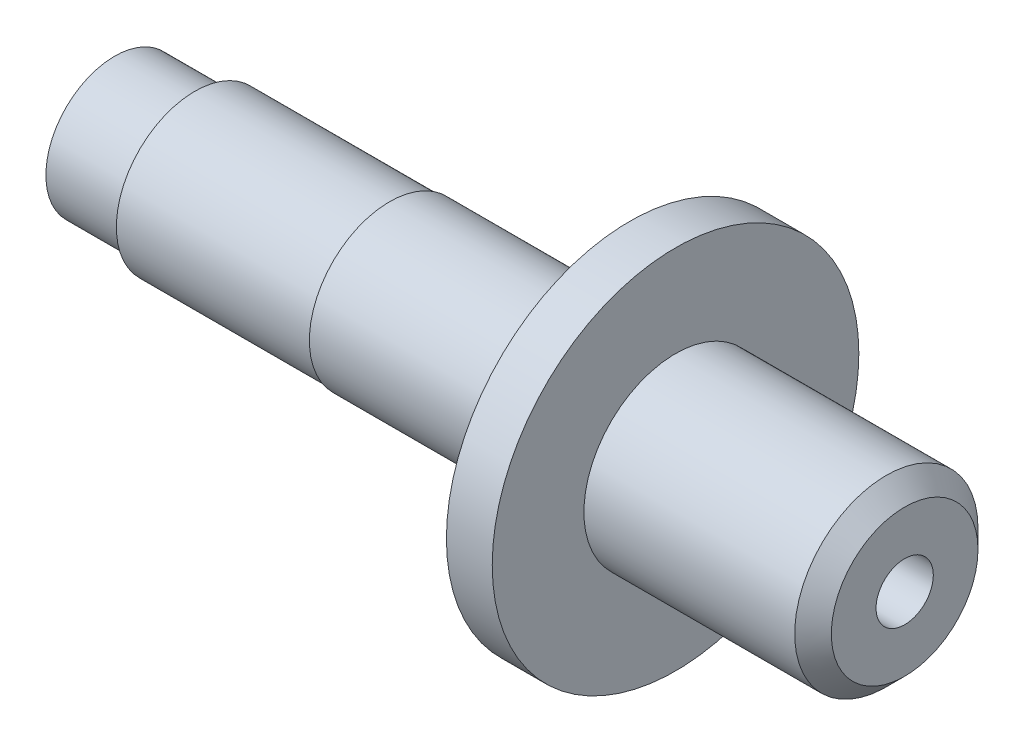
ISO-10303-21;
HEADER;
FILE_DESCRIPTION(('STEP AP214'),'2;1');
FILE_NAME('part.step','',(''),(''),'','','');
FILE_SCHEMA(('AUTOMOTIVE_DESIGN { 1 0 10303 214 1 1 1 1 }'));
ENDSEC;
DATA;
#1=APPLICATION_CONTEXT('core data for automotive mechanical design processes');
#2=APPLICATION_PROTOCOL_DEFINITION('international standard','automotive_design',2000,#1);
#3=PRODUCT_CONTEXT('',#1,'mechanical');
#4=PRODUCT('Part','Part','',(#3));
#5=PRODUCT_RELATED_PRODUCT_CATEGORY('part','',(#4));
#6=PRODUCT_DEFINITION_FORMATION('','',#4);
#7=PRODUCT_DEFINITION_CONTEXT('part definition',#1,'design');
#8=PRODUCT_DEFINITION('design','',#6,#7);
#9=PRODUCT_DEFINITION_SHAPE('','',#8);
#10=(LENGTH_UNIT() NAMED_UNIT(*) SI_UNIT(.MILLI.,.METRE.));
#11=(NAMED_UNIT(*) PLANE_ANGLE_UNIT() SI_UNIT($,.RADIAN.));
#12=(NAMED_UNIT(*) SI_UNIT($,.STERADIAN.) SOLID_ANGLE_UNIT());
#13=UNCERTAINTY_MEASURE_WITH_UNIT(LENGTH_MEASURE(1.E-05),#10,'distance_accuracy_value','');
#14=(GEOMETRIC_REPRESENTATION_CONTEXT(3) GLOBAL_UNCERTAINTY_ASSIGNED_CONTEXT((#13)) GLOBAL_UNIT_ASSIGNED_CONTEXT((#10,
#11,#12)) REPRESENTATION_CONTEXT('',''));
#15=CARTESIAN_POINT('',(0.,0.,0.));
#16=DIRECTION('',(0.,0.,1.));
#17=DIRECTION('',(1.,0.,0.));
#18=AXIS2_PLACEMENT_3D('',#15,#16,#17);
#19=CARTESIAN_POINT('',(109.474,12.7,0.));
#20=DIRECTION('',(1.,0.,0.));
#21=DIRECTION('',(0.,0.,-0.999999999999999));
#22=AXIS2_PLACEMENT_3D('',#19,#20,#21);
#23=PLANE('',#22);
#24=CARTESIAN_POINT('',(109.474,0.,0.));
#25=DIRECTION('',(1.,0.,0.));
#26=DIRECTION('',(0.,0.,-0.999999999999999));
#27=AXIS2_PLACEMENT_3D('',#24,#25,#26);
#28=CIRCLE('',#27,10.16);
#29=CARTESIAN_POINT('',(109.474,0.,-10.16));
#30=VERTEX_POINT('',#29);
#31=EDGE_CURVE('E36',#30,#30,#28,.T.);
#32=ORIENTED_EDGE('',*,*,#31,.T.);
#33=EDGE_LOOP('',(#32));
#34=FACE_BOUND('',#33,.T.);
#35=CARTESIAN_POINT('',(109.474,0.,0.));
#36=DIRECTION('',(1.,0.,0.));
#37=DIRECTION('',(0.,0.,-0.999999999999999));
#38=AXIS2_PLACEMENT_3D('',#35,#36,#37);
#39=CIRCLE('',#38,3.96875);
#40=CARTESIAN_POINT('',(109.474,0.,-3.96875));
#41=VERTEX_POINT('',#40);
#42=EDGE_CURVE('E88',#41,#41,#39,.T.);
#43=ORIENTED_EDGE('',*,*,#42,.F.);
#44=EDGE_LOOP('',(#43));
#45=FACE_BOUND('',#44,.T.);
#46=ADVANCED_FACE('F30',(#34,#45),#23,.T.);
#47=CARTESIAN_POINT('',(109.474,0.,0.));
#48=DIRECTION('',(1.,0.,0.));
#49=DIRECTION('',(0.,0.,-0.999999999999999));
#50=AXIS2_PLACEMENT_3D('',#47,#48,#49);
#51=CYLINDRICAL_SURFACE('',#50,12.7);
#52=CARTESIAN_POINT('',(106.934,0.,0.));
#53=DIRECTION('',(1.,0.,0.));
#54=DIRECTION('',(0.,0.,-0.999999999999999));
#55=AXIS2_PLACEMENT_3D('',#52,#53,#54);
#56=CIRCLE('',#55,12.7);
#57=CARTESIAN_POINT('',(106.934,0.,-12.7));
#58=VERTEX_POINT('',#57);
#59=EDGE_CURVE('E10',#58,#58,#56,.F.);
#60=ORIENTED_EDGE('',*,*,#59,.T.);
#61=EDGE_LOOP('',(#60));
#62=FACE_BOUND('',#61,.T.);
#63=CARTESIAN_POINT('',(77.724,0.,0.));
#64=DIRECTION('',(1.,0.,0.));
#65=DIRECTION('',(0.,0.,-0.999999999999999));
#66=AXIS2_PLACEMENT_3D('',#63,#64,#65);
#67=CIRCLE('',#66,12.7);
#68=CARTESIAN_POINT('',(77.724,0.,-12.7));
#69=VERTEX_POINT('',#68);
#70=EDGE_CURVE('E40',#69,#69,#67,.T.);
#71=ORIENTED_EDGE('',*,*,#70,.T.);
#72=EDGE_LOOP('',(#71));
#73=FACE_BOUND('',#72,.T.);
#74=ADVANCED_FACE('F95',(#62,#73),#51,.T.);
#75=CARTESIAN_POINT('',(77.724,25.3999999999999,0.));
#76=DIRECTION('',(1.,0.,0.));
#77=DIRECTION('',(0.,0.,-0.999999999999999));
#78=AXIS2_PLACEMENT_3D('',#75,#76,#77);
#79=PLANE('',#78);
#80=CARTESIAN_POINT('',(77.724,0.,0.));
#81=DIRECTION('',(1.,0.,0.));
#82=DIRECTION('',(0.,0.,-0.999999999999999));
#83=AXIS2_PLACEMENT_3D('',#80,#81,#82);
#84=CIRCLE('',#83,25.4);
#85=CARTESIAN_POINT('',(77.724,0.,-25.4));
#86=VERTEX_POINT('',#85);
#87=EDGE_CURVE('E44',#86,#86,#84,.T.);
#88=ORIENTED_EDGE('',*,*,#87,.T.);
#89=EDGE_LOOP('',(#88));
#90=FACE_BOUND('',#89,.T.);
#91=ORIENTED_EDGE('',*,*,#70,.F.);
#92=EDGE_LOOP('',(#91));
#93=FACE_BOUND('',#92,.T.);
#94=ADVANCED_FACE('F99',(#90,#93),#79,.T.);
#95=CARTESIAN_POINT('',(109.474,0.,0.));
#96=DIRECTION('',(1.,0.,0.));
#97=DIRECTION('',(0.,0.,-0.999999999999999));
#98=AXIS2_PLACEMENT_3D('',#95,#96,#97);
#99=CYLINDRICAL_SURFACE('',#98,25.4);
#100=CARTESIAN_POINT('',(71.374,0.,0.));
#101=DIRECTION('',(1.,0.,0.));
#102=DIRECTION('',(0.,0.,-0.999999999999999));
#103=AXIS2_PLACEMENT_3D('',#100,#101,#102);
#104=CIRCLE('',#103,25.4);
#105=CARTESIAN_POINT('',(71.374,0.,-25.4));
#106=VERTEX_POINT('',#105);
#107=EDGE_CURVE('E49',#106,#106,#104,.T.);
#108=ORIENTED_EDGE('',*,*,#107,.T.);
#109=EDGE_LOOP('',(#108));
#110=FACE_BOUND('',#109,.T.);
#111=ORIENTED_EDGE('',*,*,#87,.F.);
#112=EDGE_LOOP('',(#111));
#113=FACE_BOUND('',#112,.T.);
#114=ADVANCED_FACE('F103',(#110,#113),#99,.T.);
#115=CARTESIAN_POINT('',(71.374,17.78,0.));
#116=DIRECTION('',(-1.,0.,0.));
#117=DIRECTION('',(0.,0.,0.999999999999999));
#118=AXIS2_PLACEMENT_3D('',#115,#116,#117);
#119=PLANE('',#118);
#120=CARTESIAN_POINT('',(71.374,0.,0.));
#121=DIRECTION('',(1.,0.,0.));
#122=DIRECTION('',(0.,0.,-0.999999999999999));
#123=AXIS2_PLACEMENT_3D('',#120,#121,#122);
#124=CIRCLE('',#123,17.78);
#125=CARTESIAN_POINT('',(71.374,0.,-17.78));
#126=VERTEX_POINT('',#125);
#127=EDGE_CURVE('E52',#126,#126,#124,.T.);
#128=ORIENTED_EDGE('',*,*,#127,.T.);
#129=EDGE_LOOP('',(#128));
#130=FACE_BOUND('',#129,.T.);
#131=ORIENTED_EDGE('',*,*,#107,.F.);
#132=EDGE_LOOP('',(#131));
#133=FACE_BOUND('',#132,.T.);
#134=ADVANCED_FACE('F110',(#130,#133),#119,.T.);
#135=CARTESIAN_POINT('',(66.294,0.,0.));
#136=DIRECTION('',(1.,0.,0.));
#137=DIRECTION('',(0.,0.,-0.999999999999999));
#138=AXIS2_PLACEMENT_3D('',#135,#136,#137);
#139=TOROIDAL_SURFACE('',#138,17.78,5.08);
#140=CARTESIAN_POINT('',(66.294,0.,0.));
#141=DIRECTION('',(1.,0.,0.));
#142=DIRECTION('',(0.,0.,-0.999999999999999));
#143=AXIS2_PLACEMENT_3D('',#140,#141,#142);
#144=CIRCLE('',#143,12.7);
#145=CARTESIAN_POINT('',(66.294,0.,-12.7));
#146=VERTEX_POINT('',#145);
#147=EDGE_CURVE('E55',#146,#146,#144,.T.);
#148=ORIENTED_EDGE('',*,*,#147,.T.);
#149=EDGE_LOOP('',(#148));
#150=FACE_BOUND('',#149,.T.);
#151=ORIENTED_EDGE('',*,*,#127,.F.);
#152=EDGE_LOOP('',(#151));
#153=FACE_BOUND('',#152,.T.);
#154=ADVANCED_FACE('F114',(#150,#153),#139,.F.);
#155=CARTESIAN_POINT('',(109.474,0.,0.));
#156=DIRECTION('',(1.,0.,0.));
#157=DIRECTION('',(0.,0.,-0.999999999999999));
#158=AXIS2_PLACEMENT_3D('',#155,#156,#157);
#159=CYLINDRICAL_SURFACE('',#158,12.7);
#160=CARTESIAN_POINT('',(65.024,0.,0.));
#161=DIRECTION('',(1.,0.,0.));
#162=DIRECTION('',(0.,0.,-0.999999999999999));
#163=AXIS2_PLACEMENT_3D('',#160,#161,#162);
#164=CIRCLE('',#163,12.7);
#165=CARTESIAN_POINT('',(65.024,0.,-12.7));
#166=VERTEX_POINT('',#165);
#167=EDGE_CURVE('E58',#166,#166,#164,.T.);
#168=ORIENTED_EDGE('',*,*,#167,.T.);
#169=EDGE_LOOP('',(#168));
#170=FACE_BOUND('',#169,.T.);
#171=ORIENTED_EDGE('',*,*,#147,.F.);
#172=EDGE_LOOP('',(#171));
#173=FACE_BOUND('',#172,.T.);
#174=ADVANCED_FACE('F118',(#170,#173),#159,.T.);
#175=CARTESIAN_POINT('',(65.024,11.1125,0.));
#176=DIRECTION('',(-1.,0.,0.));
#177=DIRECTION('',(0.,0.,0.999999999999999));
#178=AXIS2_PLACEMENT_3D('',#175,#176,#177);
#179=PLANE('',#178);
#180=CARTESIAN_POINT('',(65.024,0.,0.));
#181=DIRECTION('',(1.,0.,0.));
#182=DIRECTION('',(0.,0.,-0.999999999999999));
#183=AXIS2_PLACEMENT_3D('',#180,#181,#182);
#184=CIRCLE('',#183,11.1125);
#185=CARTESIAN_POINT('',(65.024,0.,-11.1125));
#186=VERTEX_POINT('',#185);
#187=EDGE_CURVE('E61',#186,#186,#184,.T.);
#188=ORIENTED_EDGE('',*,*,#187,.T.);
#189=EDGE_LOOP('',(#188));
#190=FACE_BOUND('',#189,.T.);
#191=ORIENTED_EDGE('',*,*,#167,.F.);
#192=EDGE_LOOP('',(#191));
#193=FACE_BOUND('',#192,.T.);
#194=ADVANCED_FACE('F122',(#190,#193),#179,.T.);
#195=CARTESIAN_POINT('',(109.474,0.,0.));
#196=DIRECTION('',(1.,0.,0.));
#197=DIRECTION('',(0.,0.,-0.999999999999999));
#198=AXIS2_PLACEMENT_3D('',#195,#196,#197);
#199=CYLINDRICAL_SURFACE('',#198,11.1125);
#200=CARTESIAN_POINT('',(38.1,0.,0.));
#201=DIRECTION('',(1.,0.,0.));
#202=DIRECTION('',(0.,0.,-0.999999999999999));
#203=AXIS2_PLACEMENT_3D('',#200,#201,#202);
#204=CIRCLE('',#203,11.1125);
#205=CARTESIAN_POINT('',(38.1,0.,-11.1125));
#206=VERTEX_POINT('',#205);
#207=EDGE_CURVE('E64',#206,#206,#204,.T.);
#208=ORIENTED_EDGE('',*,*,#207,.T.);
#209=EDGE_LOOP('',(#208));
#210=FACE_BOUND('',#209,.T.);
#211=ORIENTED_EDGE('',*,*,#187,.F.);
#212=EDGE_LOOP('',(#211));
#213=FACE_BOUND('',#212,.T.);
#214=ADVANCED_FACE('F126',(#210,#213),#199,.T.);
#215=CARTESIAN_POINT('',(38.1,10.8712,0.));
#216=DIRECTION('',(-1.,0.,0.));
#217=DIRECTION('',(0.,0.,0.999999999999999));
#218=AXIS2_PLACEMENT_3D('',#215,#216,#217);
#219=PLANE('',#218);
#220=CARTESIAN_POINT('',(38.1,0.,0.));
#221=DIRECTION('',(1.,0.,0.));
#222=DIRECTION('',(0.,0.,-0.999999999999999));
#223=AXIS2_PLACEMENT_3D('',#220,#221,#222);
#224=CIRCLE('',#223,10.8712);
#225=CARTESIAN_POINT('',(38.1,0.,-10.8712));
#226=VERTEX_POINT('',#225);
#227=EDGE_CURVE('E67',#226,#226,#224,.T.);
#228=ORIENTED_EDGE('',*,*,#227,.T.);
#229=EDGE_LOOP('',(#228));
#230=FACE_BOUND('',#229,.T.);
#231=ORIENTED_EDGE('',*,*,#207,.F.);
#232=EDGE_LOOP('',(#231));
#233=FACE_BOUND('',#232,.T.);
#234=ADVANCED_FACE('F130',(#230,#233),#219,.T.);
#235=CARTESIAN_POINT('',(109.474,0.,0.));
#236=DIRECTION('',(1.,0.,0.));
#237=DIRECTION('',(0.,0.,-0.999999999999999));
#238=AXIS2_PLACEMENT_3D('',#235,#236,#237);
#239=CYLINDRICAL_SURFACE('',#238,10.8712);
#240=CARTESIAN_POINT('',(11.1125,0.,0.));
#241=DIRECTION('',(1.,0.,0.));
#242=DIRECTION('',(0.,0.,-0.999999999999999));
#243=AXIS2_PLACEMENT_3D('',#240,#241,#242);
#244=CIRCLE('',#243,10.8712);
#245=CARTESIAN_POINT('',(11.1125,0.,-10.8712));
#246=VERTEX_POINT('',#245);
#247=EDGE_CURVE('E70',#246,#246,#244,.T.);
#248=ORIENTED_EDGE('',*,*,#247,.T.);
#249=EDGE_LOOP('',(#248));
#250=FACE_BOUND('',#249,.T.);
#251=ORIENTED_EDGE('',*,*,#227,.F.);
#252=EDGE_LOOP('',(#251));
#253=FACE_BOUND('',#252,.T.);
#254=ADVANCED_FACE('F134',(#250,#253),#239,.T.);
#255=CARTESIAN_POINT('',(11.1125,9.52499999999996,0.));
#256=DIRECTION('',(-1.,0.,0.));
#257=DIRECTION('',(0.,0.,0.999999999999999));
#258=AXIS2_PLACEMENT_3D('',#255,#256,#257);
#259=PLANE('',#258);
#260=CARTESIAN_POINT('',(11.1125,0.,0.));
#261=DIRECTION('',(1.,0.,0.));
#262=DIRECTION('',(0.,0.,-0.999999999999999));
#263=AXIS2_PLACEMENT_3D('',#260,#261,#262);
#264=CIRCLE('',#263,9.525);
#265=CARTESIAN_POINT('',(11.1125,0.,-9.52499999999999));
#266=VERTEX_POINT('',#265);
#267=EDGE_CURVE('E73',#266,#266,#264,.T.);
#268=ORIENTED_EDGE('',*,*,#267,.T.);
#269=EDGE_LOOP('',(#268));
#270=FACE_BOUND('',#269,.T.);
#271=ORIENTED_EDGE('',*,*,#247,.F.);
#272=EDGE_LOOP('',(#271));
#273=FACE_BOUND('',#272,.T.);
#274=ADVANCED_FACE('F138',(#270,#273),#259,.T.);
#275=CARTESIAN_POINT('',(109.474,0.,0.));
#276=DIRECTION('',(1.,0.,0.));
#277=DIRECTION('',(0.,0.,-0.999999999999999));
#278=AXIS2_PLACEMENT_3D('',#275,#276,#277);
#279=CYLINDRICAL_SURFACE('',#278,9.525);
#280=CARTESIAN_POINT('',(0.,0.,0.));
#281=DIRECTION('',(1.,0.,0.));
#282=DIRECTION('',(0.,0.,-0.999999999999999));
#283=AXIS2_PLACEMENT_3D('',#280,#281,#282);
#284=CIRCLE('',#283,9.525);
#285=CARTESIAN_POINT('',(0.,0.,-9.52499999999999));
#286=VERTEX_POINT('',#285);
#287=EDGE_CURVE('E76',#286,#286,#284,.T.);
#288=ORIENTED_EDGE('',*,*,#287,.T.);
#289=EDGE_LOOP('',(#288));
#290=FACE_BOUND('',#289,.T.);
#291=ORIENTED_EDGE('',*,*,#267,.F.);
#292=EDGE_LOOP('',(#291));
#293=FACE_BOUND('',#292,.T.);
#294=ADVANCED_FACE('F142',(#290,#293),#279,.T.);
#295=CARTESIAN_POINT('',(0.,0.,0.));
#296=DIRECTION('',(-1.,0.,0.));
#297=DIRECTION('',(0.,0.,0.999999999999999));
#298=AXIS2_PLACEMENT_3D('',#295,#296,#297);
#299=PLANE('',#298);
#300=CARTESIAN_POINT('',(0.,0.,0.));
#301=DIRECTION('',(-1.,0.,0.));
#302=DIRECTION('',(0.,0.,0.999999999999999));
#303=AXIS2_PLACEMENT_3D('',#300,#301,#302);
#304=CIRCLE('',#303,3.96875);
#305=CARTESIAN_POINT('',(0.,0.,3.96875));
#306=VERTEX_POINT('',#305);
#307=EDGE_CURVE('E82',#306,#306,#304,.T.);
#308=ORIENTED_EDGE('',*,*,#307,.F.);
#309=EDGE_LOOP('',(#308));
#310=FACE_BOUND('',#309,.T.);
#311=ORIENTED_EDGE('',*,*,#287,.F.);
#312=EDGE_LOOP('',(#311));
#313=FACE_BOUND('',#312,.T.);
#314=ADVANCED_FACE('F146',(#310,#313),#299,.T.);
#315=CARTESIAN_POINT('',(28.575,0.,0.));
#316=DIRECTION('',(-1.,0.,0.));
#317=DIRECTION('',(0.,0.,0.999999999999999));
#318=AXIS2_PLACEMENT_3D('',#315,#316,#317);
#319=CYLINDRICAL_SURFACE('',#318,3.96875);
#320=CARTESIAN_POINT('',(28.575,0.,0.));
#321=DIRECTION('',(-1.,0.,0.));
#322=DIRECTION('',(0.,0.,0.999999999999999));
#323=AXIS2_PLACEMENT_3D('',#320,#321,#322);
#324=CIRCLE('',#323,3.96875);
#325=CARTESIAN_POINT('',(28.575,0.,3.96875));
#326=VERTEX_POINT('',#325);
#327=EDGE_CURVE('E79',#326,#326,#324,.T.);
#328=ORIENTED_EDGE('',*,*,#327,.F.);
#329=EDGE_LOOP('',(#328));
#330=FACE_BOUND('',#329,.T.);
#331=ORIENTED_EDGE('',*,*,#307,.T.);
#332=EDGE_LOOP('',(#331));
#333=FACE_BOUND('',#332,.T.);
#334=ADVANCED_FACE('F150',(#330,#333),#319,.F.);
#335=CARTESIAN_POINT('',(28.575,0.,0.));
#336=DIRECTION('',(-1.,0.,0.));
#337=DIRECTION('',(0.,0.,0.999999999999999));
#338=AXIS2_PLACEMENT_3D('',#335,#336,#337);
#339=PLANE('',#338);
#340=ORIENTED_EDGE('',*,*,#327,.T.);
#341=EDGE_LOOP('',(#340));
#342=FACE_BOUND('',#341,.T.);
#343=ADVANCED_FACE('F154',(#342),#339,.T.);
#344=CARTESIAN_POINT('',(75.692,0.,0.));
#345=DIRECTION('',(1.,0.,0.));
#346=DIRECTION('',(0.,0.,-0.999999999999999));
#347=AXIS2_PLACEMENT_3D('',#344,#345,#346);
#348=CYLINDRICAL_SURFACE('',#347,3.96875);
#349=CARTESIAN_POINT('',(75.692,0.,0.));
#350=DIRECTION('',(1.,0.,0.));
#351=DIRECTION('',(0.,0.,-0.999999999999999));
#352=AXIS2_PLACEMENT_3D('',#349,#350,#351);
#353=CIRCLE('',#352,3.96875);
#354=CARTESIAN_POINT('',(75.692,0.,-3.96875));
#355=VERTEX_POINT('',#354);
#356=EDGE_CURVE('E85',#355,#355,#353,.T.);
#357=ORIENTED_EDGE('',*,*,#356,.F.);
#358=EDGE_LOOP('',(#357));
#359=FACE_BOUND('',#358,.T.);
#360=ORIENTED_EDGE('',*,*,#42,.T.);
#361=EDGE_LOOP('',(#360));
#362=FACE_BOUND('',#361,.T.);
#363=ADVANCED_FACE('F92',(#359,#362),#348,.F.);
#364=CARTESIAN_POINT('',(75.692,0.,0.));
#365=DIRECTION('',(1.,0.,0.));
#366=DIRECTION('',(0.,0.,-0.999999999999999));
#367=AXIS2_PLACEMENT_3D('',#364,#365,#366);
#368=PLANE('',#367);
#369=ORIENTED_EDGE('',*,*,#356,.T.);
#370=EDGE_LOOP('',(#369));
#371=FACE_BOUND('',#370,.T.);
#372=ADVANCED_FACE('F161',(#371),#368,.T.);
#373=CARTESIAN_POINT('',(109.474,0.,0.));
#374=DIRECTION('',(-1.,0.,0.));
#375=DIRECTION('',(0.,0.,0.999999999999999));
#376=AXIS2_PLACEMENT_3D('',#373,#374,#375);
#377=CONICAL_SURFACE('',#376,10.16,0.785398163397446);
#378=ORIENTED_EDGE('',*,*,#59,.F.);
#379=EDGE_LOOP('',(#378));
#380=FACE_BOUND('',#379,.T.);
#381=ORIENTED_EDGE('',*,*,#31,.F.);
#382=EDGE_LOOP('',(#381));
#383=FACE_BOUND('',#382,.T.);
#384=ADVANCED_FACE('F165',(#380,#383),#377,.T.);
#385=CLOSED_SHELL('',(#46,#74,#94,#114,#134,#154,#174,#194,#214,#234,#254,#274,#294,#314,#334,
#343,#363,#372,#384));
#386=MANIFOLD_SOLID_BREP('B2',#385);
#387=ADVANCED_BREP_SHAPE_REPRESENTATION('',(#18,#386),#14);
#388=SHAPE_DEFINITION_REPRESENTATION(#9,#387);
ENDSEC;
END-ISO-10303-21;
